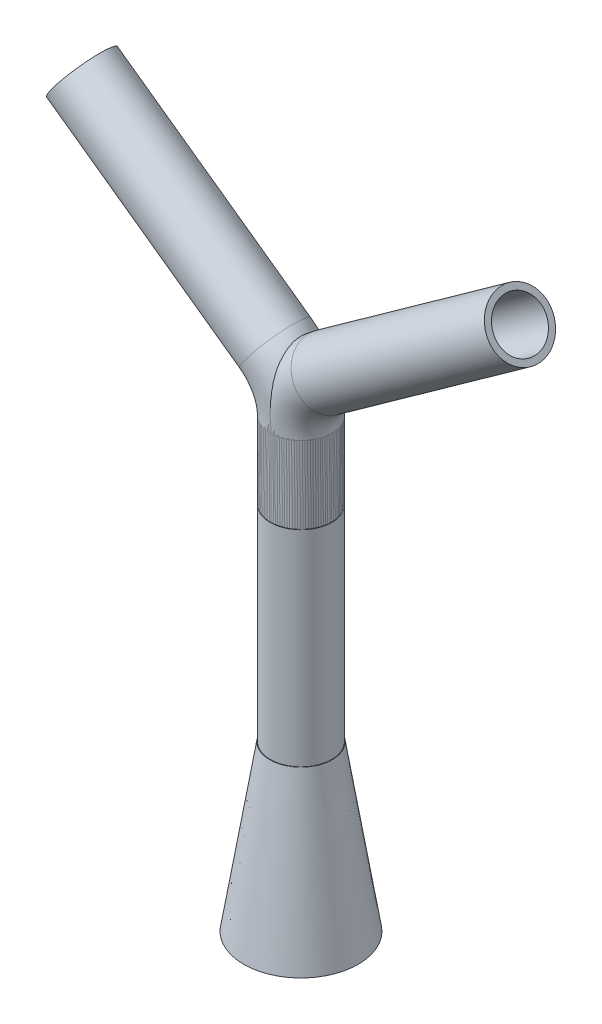
ISO-10303-21;
HEADER;
FILE_DESCRIPTION(('STEP AP214'),'2;1');
FILE_NAME('part.step','',(''),(''),'','','');
FILE_SCHEMA(('AUTOMOTIVE_DESIGN { 1 0 10303 214 1 1 1 1 }'));
ENDSEC;
DATA;
#1=APPLICATION_CONTEXT('core data for automotive mechanical design processes');
#2=APPLICATION_PROTOCOL_DEFINITION('international standard','automotive_design',2000,#1);
#3=PRODUCT_CONTEXT('',#1,'mechanical');
#4=PRODUCT('Part','Part','',(#3));
#5=PRODUCT_RELATED_PRODUCT_CATEGORY('part','',(#4));
#6=PRODUCT_DEFINITION_FORMATION('','',#4);
#7=PRODUCT_DEFINITION_CONTEXT('part definition',#1,'design');
#8=PRODUCT_DEFINITION('design','',#6,#7);
#9=PRODUCT_DEFINITION_SHAPE('','',#8);
#10=(LENGTH_UNIT() NAMED_UNIT(*) SI_UNIT(.MILLI.,.METRE.));
#11=(NAMED_UNIT(*) PLANE_ANGLE_UNIT() SI_UNIT($,.RADIAN.));
#12=(NAMED_UNIT(*) SI_UNIT($,.STERADIAN.) SOLID_ANGLE_UNIT());
#13=UNCERTAINTY_MEASURE_WITH_UNIT(LENGTH_MEASURE(1.E-05),#10,'distance_accuracy_value','');
#14=(GEOMETRIC_REPRESENTATION_CONTEXT(3) GLOBAL_UNCERTAINTY_ASSIGNED_CONTEXT((#13)) GLOBAL_UNIT_ASSIGNED_CONTEXT((#10,
#11,#12)) REPRESENTATION_CONTEXT('',''));
#15=CARTESIAN_POINT('',(0.,0.,0.));
#16=DIRECTION('',(0.,0.,1.));
#17=DIRECTION('',(1.,0.,0.));
#18=AXIS2_PLACEMENT_3D('',#15,#16,#17);
#19=CARTESIAN_POINT('',(-22872.6176832913,-5848.78536948917,40486.7001957661));
#20=DIRECTION('',(0.,1.,0.));
#21=DIRECTION('',(0.,0.,-1.));
#22=AXIS2_PLACEMENT_3D('',#19,#20,#21);
#23=PLANE('',#22);
#24=CARTESIAN_POINT('',(-22872.6176832913,-5848.78536948917,40486.7001957661));
#25=DIRECTION('',(0.,1.,0.));
#26=DIRECTION('',(0.,0.,-1.));
#27=AXIS2_PLACEMENT_3D('',#24,#25,#26);
#28=CIRCLE('',#27,12.0000000000006);
#29=CARTESIAN_POINT('',(-22872.6176832913,-5848.78536948917,40474.7001957661));
#30=VERTEX_POINT('',#29);
#31=EDGE_CURVE('E87',#30,#30,#28,.T.);
#32=ORIENTED_EDGE('',*,*,#31,.T.);
#33=EDGE_LOOP('',(#32));
#34=FACE_BOUND('',#33,.T.);
#35=CARTESIAN_POINT('',(-22872.6176832913,-5848.78536948917,40486.7001957661));
#36=DIRECTION('',(0.,1.,0.));
#37=DIRECTION('',(0.,0.,-1.));
#38=AXIS2_PLACEMENT_3D('',#35,#36,#37);
#39=CIRCLE('',#38,15.0000000000006);
#40=CARTESIAN_POINT('',(-22872.6176832913,-5848.78536948917,40471.7001957661));
#41=VERTEX_POINT('',#40);
#42=EDGE_CURVE('E78',#41,#41,#39,.T.);
#43=ORIENTED_EDGE('',*,*,#42,.F.);
#44=EDGE_LOOP('',(#43));
#45=FACE_BOUND('',#44,.T.);
#46=ADVANCED_FACE('F64',(#34,#45),#23,.F.);
#47=CARTESIAN_POINT('',(-22765.938243413,-5719.65170070495,40486.7001957661));
#48=DIRECTION('',(0.813433412105823,0.581658047369654,0.));
#49=DIRECTION('',(0.,0.,-1.));
#50=AXIS2_PLACEMENT_3D('',#47,#48,#49);
#51=PLANE('',#50);
#52=CARTESIAN_POINT('',(-22765.938243413,-5719.65170070495,40486.7001957661));
#53=DIRECTION('',(0.813433412105823,0.581658047369654,0.));
#54=DIRECTION('',(0.581658047369654,-0.813433412105823,0.));
#55=AXIS2_PLACEMENT_3D('',#52,#53,#54);
#56=CIRCLE('',#55,12.0000000000006);
#57=CARTESIAN_POINT('',(-22758.9583468446,-5729.41290165022,40486.7001957661));
#58=VERTEX_POINT('',#57);
#59=EDGE_CURVE('E83',#58,#58,#56,.T.);
#60=ORIENTED_EDGE('',*,*,#59,.F.);
#61=EDGE_LOOP('',(#60));
#62=FACE_BOUND('',#61,.T.);
#63=CARTESIAN_POINT('',(-22765.938243413,-5719.65170070495,40486.7001957661));
#64=DIRECTION('',(0.813433412105823,0.581658047369654,0.));
#65=DIRECTION('',(0.,0.,-1.));
#66=AXIS2_PLACEMENT_3D('',#63,#64,#65);
#67=CIRCLE('',#66,15.0000000000006);
#68=CARTESIAN_POINT('',(-22765.938243413,-5719.65170070495,40471.7001957661));
#69=VERTEX_POINT('',#68);
#70=EDGE_CURVE('E12',#69,#69,#67,.T.);
#71=ORIENTED_EDGE('',*,*,#70,.T.);
#72=EDGE_LOOP('',(#71));
#73=FACE_BOUND('',#72,.T.);
#74=ADVANCED_FACE('F123',(#62,#73),#51,.T.);
#75=CARTESIAN_POINT('',(-22872.6176832913,-5848.78536948917,40486.7001957661));
#76=DIRECTION('',(0.,1.,0.));
#77=DIRECTION('',(0.,0.,-1.));
#78=AXIS2_PLACEMENT_3D('',#75,#76,#77);
#79=CYLINDRICAL_SURFACE('',#78,15.0000000000006);
#80=CARTESIAN_POINT('',(-22872.6176832913,-5811.36321902072,40486.7001957661));
#81=DIRECTION('',(0.,1.,0.));
#82=DIRECTION('',(0.,0.,-1.));
#83=AXIS2_PLACEMENT_3D('',#80,#81,#82);
#84=CIRCLE('',#83,15.0000000000006);
#85=CARTESIAN_POINT('',(-22887.6176832913,-5811.36321902072,40486.7001957661));
#86=VERTEX_POINT('',#85);
#87=EDGE_CURVE('E74',#86,#86,#84,.T.);
#88=ORIENTED_EDGE('',*,*,#87,.F.);
#89=EDGE_LOOP('',(#88));
#90=FACE_BOUND('',#89,.T.);
#91=ORIENTED_EDGE('',*,*,#42,.T.);
#92=EDGE_LOOP('',(#91));
#93=FACE_BOUND('',#92,.T.);
#94=ADVANCED_FACE('F119',(#90,#93),#79,.T.);
#95=CARTESIAN_POINT('',(-22842.6176832913,-5811.36321902072,40486.7001957661));
#96=DIRECTION('',(0.,0.,-1.));
#97=DIRECTION('',(-1.,0.,0.));
#98=AXIS2_PLACEMENT_3D('',#95,#96,#97);
#99=TOROIDAL_SURFACE('',#98,30.0000000000011,15.0000000000006);
#100=CARTESIAN_POINT('',(-22860.0674247124,-5786.96021665754,40486.7001957661));
#101=DIRECTION('',(0.813433412105845,0.581658047369623,0.));
#102=DIRECTION('',(0.,0.,-1.));
#103=AXIS2_PLACEMENT_3D('',#100,#101,#102);
#104=CIRCLE('',#103,15.0000000000006);
#105=CARTESIAN_POINT('',(-22868.7922954229,-5774.75871547595,40486.7001957661));
#106=VERTEX_POINT('',#105);
#107=EDGE_CURVE('E70',#106,#106,#104,.T.);
#108=CARTESIAN_POINT('',(-22842.6176832913,-5811.36321902072,40486.7001957661));
#109=DIRECTION('',(0.,0.,-1.));
#110=DIRECTION('',(-1.,0.,0.));
#111=AXIS2_PLACEMENT_3D('',#108,#109,#110);
#112=CIRCLE('',#111,45.0000000000017);
#113=EDGE_CURVE('',#86,#106,#112,.T.);
#114=ORIENTED_EDGE('',*,*,#87,.T.);
#115=ORIENTED_EDGE('',*,*,#107,.F.);
#116=ORIENTED_EDGE('',*,*,#113,.T.);
#117=ORIENTED_EDGE('',*,*,#113,.F.);
#118=EDGE_LOOP('',(#114,#116,#115,#117));
#119=FACE_BOUND('',#118,.T.);
#120=ADVANCED_FACE('F113',(#119),#99,.T.);
#121=CARTESIAN_POINT('',(-22860.0674247124,-5786.96021665754,40486.7001957661));
#122=DIRECTION('',(0.813433412105823,0.581658047369654,0.));
#123=DIRECTION('',(0.581658047369654,-0.813433412105823,0.));
#124=AXIS2_PLACEMENT_3D('',#121,#122,#123);
#125=CYLINDRICAL_SURFACE('',#124,15.0000000000006);
#126=ORIENTED_EDGE('',*,*,#70,.F.);
#127=EDGE_LOOP('',(#126));
#128=FACE_BOUND('',#127,.T.);
#129=ORIENTED_EDGE('',*,*,#107,.T.);
#130=EDGE_LOOP('',(#129));
#131=FACE_BOUND('',#130,.T.);
#132=ADVANCED_FACE('F110',(#128,#131),#125,.T.);
#133=CARTESIAN_POINT('',(-22872.6176832913,-5848.78536948917,40486.7001957661));
#134=DIRECTION('',(0.,1.,0.));
#135=DIRECTION('',(0.,0.,-1.));
#136=AXIS2_PLACEMENT_3D('',#133,#134,#135);
#137=CYLINDRICAL_SURFACE('',#136,12.0000000000006);
#138=CARTESIAN_POINT('',(-22872.6176832913,-5811.36321902072,40486.7001957661));
#139=DIRECTION('',(0.,-1.,0.));
#140=DIRECTION('',(0.,0.,1.));
#141=AXIS2_PLACEMENT_3D('',#138,#139,#140);
#142=CIRCLE('',#141,12.0000000000006);
#143=CARTESIAN_POINT('',(-22884.6176832913,-5811.36321902072,40486.7001957661));
#144=VERTEX_POINT('',#143);
#145=EDGE_CURVE('E90',#144,#144,#142,.F.);
#146=ORIENTED_EDGE('',*,*,#145,.T.);
#147=EDGE_LOOP('',(#146));
#148=FACE_BOUND('',#147,.T.);
#149=ORIENTED_EDGE('',*,*,#31,.F.);
#150=EDGE_LOOP('',(#149));
#151=FACE_BOUND('',#150,.T.);
#152=ADVANCED_FACE('F96',(#148,#151),#137,.F.);
#153=CARTESIAN_POINT('',(-22842.6176832913,-5811.36321902072,40486.7001957661));
#154=DIRECTION('',(0.,0.,-1.));
#155=DIRECTION('',(-1.,0.,0.));
#156=AXIS2_PLACEMENT_3D('',#153,#154,#155);
#157=TOROIDAL_SURFACE('',#156,30.0000000000011,12.0000000000006);
#158=CARTESIAN_POINT('',(-22860.0674247124,-5786.96021665754,40486.7001957661));
#159=DIRECTION('',(0.813433412105823,0.581658047369654,0.));
#160=DIRECTION('',(0.581658047369654,-0.813433412105823,0.));
#161=AXIS2_PLACEMENT_3D('',#158,#159,#160);
#162=CIRCLE('',#161,12.0000000000006);
#163=CARTESIAN_POINT('',(-22867.0473212808,-5777.19901571227,40486.7001957661));
#164=VERTEX_POINT('',#163);
#165=EDGE_CURVE('E86',#164,#164,#162,.T.);
#166=CARTESIAN_POINT('',(-22842.6176832913,-5811.36321902072,40486.7001957661));
#167=DIRECTION('',(0.,0.,-1.));
#168=DIRECTION('',(-1.,0.,0.));
#169=AXIS2_PLACEMENT_3D('',#166,#167,#168);
#170=CIRCLE('',#169,42.0000000000017);
#171=EDGE_CURVE('',#144,#164,#170,.T.);
#172=ORIENTED_EDGE('',*,*,#145,.F.);
#173=ORIENTED_EDGE('',*,*,#165,.T.);
#174=ORIENTED_EDGE('',*,*,#171,.T.);
#175=ORIENTED_EDGE('',*,*,#171,.F.);
#176=EDGE_LOOP('',(#172,#174,#173,#175));
#177=FACE_BOUND('',#176,.T.);
#178=ADVANCED_FACE('F99',(#177),#157,.F.);
#179=CARTESIAN_POINT('',(-22860.0674247124,-5786.96021665754,40486.7001957661));
#180=DIRECTION('',(0.813433412105823,0.581658047369654,0.));
#181=DIRECTION('',(0.581658047369654,-0.813433412105823,0.));
#182=AXIS2_PLACEMENT_3D('',#179,#180,#181);
#183=CYLINDRICAL_SURFACE('',#182,12.0000000000006);
#184=ORIENTED_EDGE('',*,*,#59,.T.);
#185=EDGE_LOOP('',(#184));
#186=FACE_BOUND('',#185,.T.);
#187=ORIENTED_EDGE('',*,*,#165,.F.);
#188=EDGE_LOOP('',(#187));
#189=FACE_BOUND('',#188,.T.);
#190=ADVANCED_FACE('F101',(#186,#189),#183,.F.);
#191=CLOSED_SHELL('',(#46,#74,#94,#120,#132,#152,#178,#190));
#192=MANIFOLD_SOLID_BREP('B2',#191);
#193=CARTESIAN_POINT('',(-22872.6176832913,-5848.78536948917,40486.7001957661));
#194=DIRECTION('',(0.,1.,0.));
#195=DIRECTION('',(0.,0.,1.));
#196=AXIS2_PLACEMENT_3D('',#193,#194,#195);
#197=PLANE('',#196);
#198=CARTESIAN_POINT('',(-22872.6176832913,-5848.78536948917,40486.7001957661));
#199=DIRECTION('',(0.,1.,0.));
#200=DIRECTION('',(0.,0.,1.));
#201=AXIS2_PLACEMENT_3D('',#198,#199,#200);
#202=CIRCLE('',#201,12.0000000000006);
#203=CARTESIAN_POINT('',(-22872.6176832913,-5848.78536948917,40498.7001957661));
#204=VERTEX_POINT('',#203);
#205=EDGE_CURVE('E232',#204,#204,#202,.T.);
#206=ORIENTED_EDGE('',*,*,#205,.T.);
#207=EDGE_LOOP('',(#206));
#208=FACE_BOUND('',#207,.T.);
#209=CARTESIAN_POINT('',(-22872.6176832913,-5848.78536948917,40486.7001957661));
#210=DIRECTION('',(0.,1.,0.));
#211=DIRECTION('',(0.,0.,1.));
#212=AXIS2_PLACEMENT_3D('',#209,#210,#211);
#213=CIRCLE('',#212,15.0000000000006);
#214=CARTESIAN_POINT('',(-22872.6176832913,-5848.78536948917,40501.7001957661));
#215=VERTEX_POINT('',#214);
#216=EDGE_CURVE('E223',#215,#215,#213,.T.);
#217=ORIENTED_EDGE('',*,*,#216,.F.);
#218=EDGE_LOOP('',(#217));
#219=FACE_BOUND('',#218,.T.);
#220=ADVANCED_FACE('F209',(#208,#219),#197,.F.);
#221=CARTESIAN_POINT('',(-22979.2971231696,-5719.65170070495,40486.7001957661));
#222=DIRECTION('',(-0.813433412105823,0.581658047369654,0.));
#223=DIRECTION('',(0.,0.,1.));
#224=AXIS2_PLACEMENT_3D('',#221,#222,#223);
#225=PLANE('',#224);
#226=CARTESIAN_POINT('',(-22979.2971231696,-5719.65170070495,40486.7001957661));
#227=DIRECTION('',(-0.813433412105823,0.581658047369654,0.));
#228=DIRECTION('',(-0.581658047369654,-0.813433412105823,0.));
#229=AXIS2_PLACEMENT_3D('',#226,#227,#228);
#230=CIRCLE('',#229,12.0000000000006);
#231=CARTESIAN_POINT('',(-22986.277019738,-5729.41290165022,40486.7001957661));
#232=VERTEX_POINT('',#231);
#233=EDGE_CURVE('E228',#232,#232,#230,.T.);
#234=ORIENTED_EDGE('',*,*,#233,.F.);
#235=EDGE_LOOP('',(#234));
#236=FACE_BOUND('',#235,.T.);
#237=CARTESIAN_POINT('',(-22979.2971231696,-5719.65170070495,40486.7001957661));
#238=DIRECTION('',(-0.813433412105823,0.581658047369654,0.));
#239=DIRECTION('',(0.,0.,1.));
#240=AXIS2_PLACEMENT_3D('',#237,#238,#239);
#241=CIRCLE('',#240,15.0000000000006);
#242=CARTESIAN_POINT('',(-22979.2971231696,-5719.65170070495,40501.7001957661));
#243=VERTEX_POINT('',#242);
#244=EDGE_CURVE('E63',#243,#243,#241,.T.);
#245=ORIENTED_EDGE('',*,*,#244,.T.);
#246=EDGE_LOOP('',(#245));
#247=FACE_BOUND('',#246,.T.);
#248=ADVANCED_FACE('F268',(#236,#247),#225,.T.);
#249=CARTESIAN_POINT('',(-22872.6176832913,-5848.78536948917,40486.7001957661));
#250=DIRECTION('',(0.,1.,0.));
#251=DIRECTION('',(0.,0.,1.));
#252=AXIS2_PLACEMENT_3D('',#249,#250,#251);
#253=CYLINDRICAL_SURFACE('',#252,15.0000000000006);
#254=CARTESIAN_POINT('',(-22872.6176832913,-5811.36321902072,40486.7001957661));
#255=DIRECTION('',(0.,1.,0.));
#256=DIRECTION('',(0.,0.,1.));
#257=AXIS2_PLACEMENT_3D('',#254,#255,#256);
#258=CIRCLE('',#257,15.0000000000006);
#259=CARTESIAN_POINT('',(-22857.6176832913,-5811.36321902072,40486.7001957661));
#260=VERTEX_POINT('',#259);
#261=EDGE_CURVE('E219',#260,#260,#258,.T.);
#262=ORIENTED_EDGE('',*,*,#261,.F.);
#263=EDGE_LOOP('',(#262));
#264=FACE_BOUND('',#263,.T.);
#265=ORIENTED_EDGE('',*,*,#216,.T.);
#266=EDGE_LOOP('',(#265));
#267=FACE_BOUND('',#266,.T.);
#268=ADVANCED_FACE('F264',(#264,#267),#253,.T.);
#269=CARTESIAN_POINT('',(-22902.6176832913,-5811.36321902072,40486.7001957661));
#270=DIRECTION('',(0.,0.,1.));
#271=DIRECTION('',(1.,0.,0.));
#272=AXIS2_PLACEMENT_3D('',#269,#270,#271);
#273=TOROIDAL_SURFACE('',#272,30.0000000000011,15.0000000000006);
#274=CARTESIAN_POINT('',(-22885.1679418702,-5786.96021665754,40486.7001957661));
#275=DIRECTION('',(-0.813433412105845,0.581658047369623,0.));
#276=DIRECTION('',(0.,0.,1.));
#277=AXIS2_PLACEMENT_3D('',#274,#275,#276);
#278=CIRCLE('',#277,15.0000000000006);
#279=CARTESIAN_POINT('',(-22876.4430711597,-5774.75871547595,40486.7001957661));
#280=VERTEX_POINT('',#279);
#281=EDGE_CURVE('E215',#280,#280,#278,.T.);
#282=CARTESIAN_POINT('',(-22902.6176832913,-5811.36321902072,40486.7001957661));
#283=DIRECTION('',(0.,0.,1.));
#284=DIRECTION('',(1.,0.,0.));
#285=AXIS2_PLACEMENT_3D('',#282,#283,#284);
#286=CIRCLE('',#285,45.0000000000017);
#287=EDGE_CURVE('',#260,#280,#286,.T.);
#288=ORIENTED_EDGE('',*,*,#261,.T.);
#289=ORIENTED_EDGE('',*,*,#281,.F.);
#290=ORIENTED_EDGE('',*,*,#287,.T.);
#291=ORIENTED_EDGE('',*,*,#287,.F.);
#292=EDGE_LOOP('',(#288,#290,#289,#291));
#293=FACE_BOUND('',#292,.T.);
#294=ADVANCED_FACE('F258',(#293),#273,.T.);
#295=CARTESIAN_POINT('',(-22885.1679418702,-5786.96021665754,40486.7001957661));
#296=DIRECTION('',(-0.813433412105823,0.581658047369654,0.));
#297=DIRECTION('',(-0.581658047369654,-0.813433412105823,0.));
#298=AXIS2_PLACEMENT_3D('',#295,#296,#297);
#299=CYLINDRICAL_SURFACE('',#298,15.0000000000006);
#300=ORIENTED_EDGE('',*,*,#244,.F.);
#301=EDGE_LOOP('',(#300));
#302=FACE_BOUND('',#301,.T.);
#303=ORIENTED_EDGE('',*,*,#281,.T.);
#304=EDGE_LOOP('',(#303));
#305=FACE_BOUND('',#304,.T.);
#306=ADVANCED_FACE('F255',(#302,#305),#299,.T.);
#307=CARTESIAN_POINT('',(-22872.6176832913,-5848.78536948917,40486.7001957661));
#308=DIRECTION('',(0.,1.,0.));
#309=DIRECTION('',(0.,0.,1.));
#310=AXIS2_PLACEMENT_3D('',#307,#308,#309);
#311=CYLINDRICAL_SURFACE('',#310,12.0000000000006);
#312=CARTESIAN_POINT('',(-22872.6176832913,-5811.36321902072,40486.7001957661));
#313=DIRECTION('',(0.,-1.,0.));
#314=DIRECTION('',(0.,0.,-1.));
#315=AXIS2_PLACEMENT_3D('',#312,#313,#314);
#316=CIRCLE('',#315,12.0000000000006);
#317=CARTESIAN_POINT('',(-22860.6176832913,-5811.36321902072,40486.7001957661));
#318=VERTEX_POINT('',#317);
#319=EDGE_CURVE('E235',#318,#318,#316,.F.);
#320=ORIENTED_EDGE('',*,*,#319,.T.);
#321=EDGE_LOOP('',(#320));
#322=FACE_BOUND('',#321,.T.);
#323=ORIENTED_EDGE('',*,*,#205,.F.);
#324=EDGE_LOOP('',(#323));
#325=FACE_BOUND('',#324,.T.);
#326=ADVANCED_FACE('F241',(#322,#325),#311,.F.);
#327=CARTESIAN_POINT('',(-22902.6176832913,-5811.36321902072,40486.7001957661));
#328=DIRECTION('',(0.,0.,1.));
#329=DIRECTION('',(1.,0.,0.));
#330=AXIS2_PLACEMENT_3D('',#327,#328,#329);
#331=TOROIDAL_SURFACE('',#330,30.0000000000011,12.0000000000006);
#332=CARTESIAN_POINT('',(-22885.1679418702,-5786.96021665754,40486.7001957661));
#333=DIRECTION('',(-0.813433412105823,0.581658047369654,0.));
#334=DIRECTION('',(-0.581658047369654,-0.813433412105823,0.));
#335=AXIS2_PLACEMENT_3D('',#332,#333,#334);
#336=CIRCLE('',#335,12.0000000000006);
#337=CARTESIAN_POINT('',(-22878.1880453018,-5777.19901571227,40486.7001957661));
#338=VERTEX_POINT('',#337);
#339=EDGE_CURVE('E231',#338,#338,#336,.T.);
#340=CARTESIAN_POINT('',(-22902.6176832913,-5811.36321902072,40486.7001957661));
#341=DIRECTION('',(0.,0.,1.));
#342=DIRECTION('',(1.,0.,0.));
#343=AXIS2_PLACEMENT_3D('',#340,#341,#342);
#344=CIRCLE('',#343,42.0000000000017);
#345=EDGE_CURVE('',#318,#338,#344,.T.);
#346=ORIENTED_EDGE('',*,*,#319,.F.);
#347=ORIENTED_EDGE('',*,*,#339,.T.);
#348=ORIENTED_EDGE('',*,*,#345,.T.);
#349=ORIENTED_EDGE('',*,*,#345,.F.);
#350=EDGE_LOOP('',(#346,#348,#347,#349));
#351=FACE_BOUND('',#350,.T.);
#352=ADVANCED_FACE('F244',(#351),#331,.F.);
#353=CARTESIAN_POINT('',(-22885.1679418702,-5786.96021665754,40486.7001957661));
#354=DIRECTION('',(-0.813433412105823,0.581658047369654,0.));
#355=DIRECTION('',(-0.581658047369654,-0.813433412105823,0.));
#356=AXIS2_PLACEMENT_3D('',#353,#354,#355);
#357=CYLINDRICAL_SURFACE('',#356,12.0000000000006);
#358=ORIENTED_EDGE('',*,*,#233,.T.);
#359=EDGE_LOOP('',(#358));
#360=FACE_BOUND('',#359,.T.);
#361=ORIENTED_EDGE('',*,*,#339,.F.);
#362=EDGE_LOOP('',(#361));
#363=FACE_BOUND('',#362,.T.);
#364=ADVANCED_FACE('F246',(#360,#363),#357,.F.);
#365=CLOSED_SHELL('',(#220,#248,#268,#294,#306,#326,#352,#364));
#366=MANIFOLD_SOLID_BREP('B7',#365);
#367=CARTESIAN_POINT('',(-22872.6176832913,-6028.96566858044,40486.7001957661));
#368=DIRECTION('',(0.,-1.,0.));
#369=DIRECTION('',(0.,0.,1.));
#370=AXIS2_PLACEMENT_3D('',#367,#368,#369);
#371=CONICAL_SURFACE('',#370,27.9,0.15707963267949);
#372=CARTESIAN_POINT('',(-22872.6176832913,-5948.96566858044,40486.7001957661));
#373=DIRECTION('',(0.,1.,0.));
#374=DIRECTION('',(0.,0.,1.));
#375=AXIS2_PLACEMENT_3D('',#372,#373,#374);
#376=CIRCLE('',#375,15.2292447740371);
#377=CARTESIAN_POINT('',(-22872.6176832913,-5948.96566858044,40501.9294405401));
#378=VERTEX_POINT('',#377);
#379=EDGE_CURVE('E350',#378,#378,#376,.T.);
#380=ORIENTED_EDGE('',*,*,#379,.F.);
#381=EDGE_LOOP('',(#380));
#382=FACE_BOUND('',#381,.T.);
#383=CARTESIAN_POINT('',(-22872.6176832913,-6028.96566858044,40486.7001957661));
#384=DIRECTION('',(0.,1.,0.));
#385=DIRECTION('',(0.,0.,1.));
#386=AXIS2_PLACEMENT_3D('',#383,#384,#385);
#387=CIRCLE('',#386,27.9);
#388=CARTESIAN_POINT('',(-22872.6176832913,-6028.96566858044,40514.6001957661));
#389=VERTEX_POINT('',#388);
#390=EDGE_CURVE('E358',#389,#389,#387,.T.);
#391=ORIENTED_EDGE('',*,*,#390,.T.);
#392=EDGE_LOOP('',(#391));
#393=FACE_BOUND('',#392,.T.);
#394=ADVANCED_FACE('F347',(#382,#393),#371,.T.);
#395=CARTESIAN_POINT('',(0.,-5948.96566858044,0.));
#396=DIRECTION('',(0.,1.,0.));
#397=DIRECTION('',(0.,0.,1.));
#398=AXIS2_PLACEMENT_3D('',#395,#396,#397);
#399=PLANE('',#398);
#400=CARTESIAN_POINT('',(-22872.6176832913,-5948.96566858044,40486.7001957661));
#401=DIRECTION('',(0.,1.,0.));
#402=DIRECTION('',(0.,0.,1.));
#403=AXIS2_PLACEMENT_3D('',#400,#401,#402);
#404=CIRCLE('',#403,15.0000000000006);
#405=CARTESIAN_POINT('',(-22872.6176832913,-5948.96566858044,40501.7001957661));
#406=VERTEX_POINT('',#405);
#407=EDGE_CURVE('E208',#406,#406,#404,.T.);
#408=ORIENTED_EDGE('',*,*,#407,.F.);
#409=EDGE_LOOP('',(#408));
#410=FACE_BOUND('',#409,.T.);
#411=ORIENTED_EDGE('',*,*,#379,.T.);
#412=EDGE_LOOP('',(#411));
#413=FACE_BOUND('',#412,.T.);
#414=ADVANCED_FACE('F376',(#410,#413),#399,.T.);
#415=CARTESIAN_POINT('',(0.,-6028.96566858044,0.));
#416=DIRECTION('',(0.,1.,0.));
#417=DIRECTION('',(0.,0.,1.));
#418=AXIS2_PLACEMENT_3D('',#415,#416,#417);
#419=PLANE('',#418);
#420=CARTESIAN_POINT('',(-22872.6176832913,-6028.96566858044,40486.7001957661));
#421=DIRECTION('',(0.,1.,0.));
#422=DIRECTION('',(0.,0.,1.));
#423=AXIS2_PLACEMENT_3D('',#420,#421,#422);
#424=CIRCLE('',#423,24.6707552259701);
#425=CARTESIAN_POINT('',(-22872.6176832913,-6028.96566858044,40511.3709509921));
#426=VERTEX_POINT('',#425);
#427=EDGE_CURVE('E366',#426,#426,#424,.T.);
#428=ORIENTED_EDGE('',*,*,#427,.T.);
#429=EDGE_LOOP('',(#428));
#430=FACE_BOUND('',#429,.T.);
#431=ORIENTED_EDGE('',*,*,#390,.F.);
#432=EDGE_LOOP('',(#431));
#433=FACE_BOUND('',#432,.T.);
#434=ADVANCED_FACE('F373',(#430,#433),#419,.F.);
#435=CARTESIAN_POINT('',(-22872.6176832913,-5948.96566858044,40486.7001957661));
#436=DIRECTION('',(0.,-1.,0.));
#437=DIRECTION('',(0.,0.,1.));
#438=AXIS2_PLACEMENT_3D('',#435,#436,#437);
#439=CONICAL_SURFACE('',#438,12.0000000000072,0.15707963267949);
#440=ORIENTED_EDGE('',*,*,#427,.F.);
#441=EDGE_LOOP('',(#440));
#442=FACE_BOUND('',#441,.T.);
#443=CARTESIAN_POINT('',(-22872.6176832913,-5948.96566858044,40486.7001957661));
#444=DIRECTION('',(0.,1.,0.));
#445=DIRECTION('',(0.,0.,1.));
#446=AXIS2_PLACEMENT_3D('',#443,#444,#445);
#447=CIRCLE('',#446,12.0000000000006);
#448=CARTESIAN_POINT('',(-22872.6176832913,-5948.96566858044,40498.7001957661));
#449=VERTEX_POINT('',#448);
#450=EDGE_CURVE('E361',#449,#449,#447,.T.);
#451=ORIENTED_EDGE('',*,*,#450,.T.);
#452=EDGE_LOOP('',(#451));
#453=FACE_BOUND('',#452,.T.);
#454=ADVANCED_FACE('F375',(#442,#453),#439,.F.);
#455=CARTESIAN_POINT('',(-22872.6176832913,-5848.96566858044,40486.7001957661));
#456=DIRECTION('',(0.,1.,0.));
#457=DIRECTION('',(0.,0.,1.));
#458=AXIS2_PLACEMENT_3D('',#455,#456,#457);
#459=PLANE('',#458);
#460=CARTESIAN_POINT('',(-22872.6176832913,-5848.96566858044,40486.7001957661));
#461=DIRECTION('',(0.,1.,0.));
#462=DIRECTION('',(0.,0.,1.));
#463=AXIS2_PLACEMENT_3D('',#460,#461,#462);
#464=CIRCLE('',#463,12.0000000000006);
#465=CARTESIAN_POINT('',(-22872.6176832913,-5848.96566858044,40498.7001957661));
#466=VERTEX_POINT('',#465);
#467=EDGE_CURVE('E367',#466,#466,#464,.T.);
#468=ORIENTED_EDGE('',*,*,#467,.F.);
#469=EDGE_LOOP('',(#468));
#470=FACE_BOUND('',#469,.T.);
#471=CARTESIAN_POINT('',(-22872.6176832913,-5848.96566858044,40486.7001957661));
#472=DIRECTION('',(0.,1.,0.));
#473=DIRECTION('',(0.,0.,1.));
#474=AXIS2_PLACEMENT_3D('',#471,#472,#473);
#475=CIRCLE('',#474,15.0000000000006);
#476=CARTESIAN_POINT('',(-22872.6176832913,-5848.96566858044,40501.7001957661));
#477=VERTEX_POINT('',#476);
#478=EDGE_CURVE('E363',#477,#477,#475,.T.);
#479=ORIENTED_EDGE('',*,*,#478,.T.);
#480=EDGE_LOOP('',(#479));
#481=FACE_BOUND('',#480,.T.);
#482=ADVANCED_FACE('F382',(#470,#481),#459,.T.);
#483=CARTESIAN_POINT('',(-22872.6176832913,-5948.96566858044,40486.7001957661));
#484=DIRECTION('',(0.,1.,0.));
#485=DIRECTION('',(0.,0.,1.));
#486=AXIS2_PLACEMENT_3D('',#483,#484,#485);
#487=CYLINDRICAL_SURFACE('',#486,15.0000000000006);
#488=ORIENTED_EDGE('',*,*,#478,.F.);
#489=EDGE_LOOP('',(#488));
#490=FACE_BOUND('',#489,.T.);
#491=ORIENTED_EDGE('',*,*,#407,.T.);
#492=EDGE_LOOP('',(#491));
#493=FACE_BOUND('',#492,.T.);
#494=ADVANCED_FACE('F385',(#490,#493),#487,.T.);
#495=CARTESIAN_POINT('',(-22872.6176832913,-5948.96566858044,40486.7001957661));
#496=DIRECTION('',(0.,1.,0.));
#497=DIRECTION('',(0.,0.,1.));
#498=AXIS2_PLACEMENT_3D('',#495,#496,#497);
#499=CYLINDRICAL_SURFACE('',#498,12.0000000000006);
#500=ORIENTED_EDGE('',*,*,#467,.T.);
#501=EDGE_LOOP('',(#500));
#502=FACE_BOUND('',#501,.T.);
#503=ORIENTED_EDGE('',*,*,#450,.F.);
#504=EDGE_LOOP('',(#503));
#505=FACE_BOUND('',#504,.T.);
#506=ADVANCED_FACE('F414',(#502,#505),#499,.F.);
#507=CLOSED_SHELL('',(#394,#414,#434,#454,#482,#494,#506));
#508=MANIFOLD_SOLID_BREP('B58',#507);
#509=ADVANCED_BREP_SHAPE_REPRESENTATION('',(#18,#192,#366,#508),#14);
#510=SHAPE_DEFINITION_REPRESENTATION(#9,#509);
ENDSEC;
END-ISO-10303-21;
